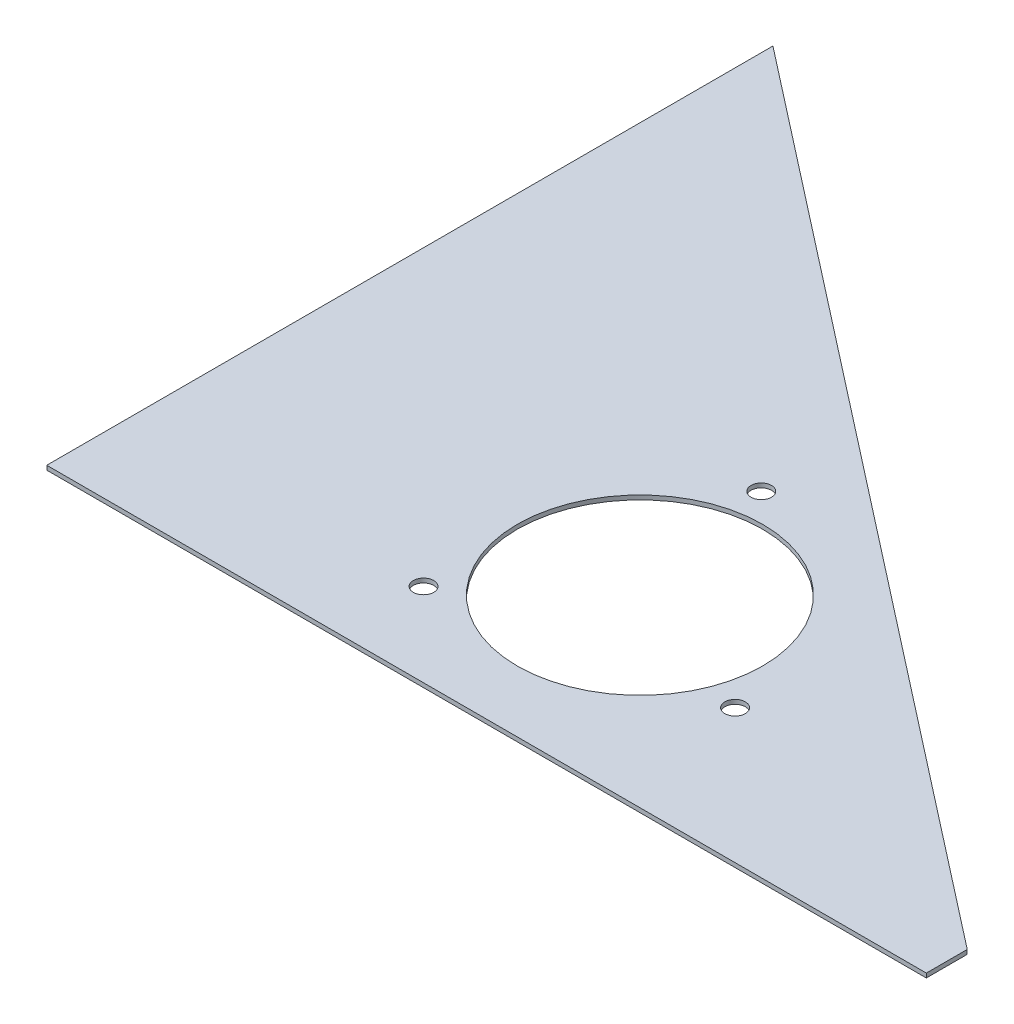
ISO-10303-21;
HEADER;
FILE_DESCRIPTION(('STEP AP214'),'2;1');
FILE_NAME('part.step','',(''),(''),'','','');
FILE_SCHEMA(('AUTOMOTIVE_DESIGN { 1 0 10303 214 1 1 1 1 }'));
ENDSEC;
DATA;
#1=APPLICATION_CONTEXT('core data for automotive mechanical design processes');
#2=APPLICATION_PROTOCOL_DEFINITION('international standard','automotive_design',2000,#1);
#3=PRODUCT_CONTEXT('',#1,'mechanical');
#4=PRODUCT('Part','Part','',(#3));
#5=PRODUCT_RELATED_PRODUCT_CATEGORY('part','',(#4));
#6=PRODUCT_DEFINITION_FORMATION('','',#4);
#7=PRODUCT_DEFINITION_CONTEXT('part definition',#1,'design');
#8=PRODUCT_DEFINITION('design','',#6,#7);
#9=PRODUCT_DEFINITION_SHAPE('','',#8);
#10=(LENGTH_UNIT() NAMED_UNIT(*) SI_UNIT(.MILLI.,.METRE.));
#11=(NAMED_UNIT(*) PLANE_ANGLE_UNIT() SI_UNIT($,.RADIAN.));
#12=(NAMED_UNIT(*) SI_UNIT($,.STERADIAN.) SOLID_ANGLE_UNIT());
#13=UNCERTAINTY_MEASURE_WITH_UNIT(LENGTH_MEASURE(1.E-05),#10,'distance_accuracy_value','');
#14=(GEOMETRIC_REPRESENTATION_CONTEXT(3) GLOBAL_UNCERTAINTY_ASSIGNED_CONTEXT((#13)) GLOBAL_UNIT_ASSIGNED_CONTEXT((#10,
#11,#12)) REPRESENTATION_CONTEXT('',''));
#15=CARTESIAN_POINT('',(0.,0.,0.));
#16=DIRECTION('',(0.,0.,1.));
#17=DIRECTION('',(1.,0.,0.));
#18=AXIS2_PLACEMENT_3D('',#15,#16,#17);
#19=CARTESIAN_POINT('',(546.1,2.65684,-25.4));
#20=DIRECTION('',(-0.614575452616154,0.,0.788858043656556));
#21=DIRECTION('',(0.788858043656556,0.,0.614575452616154));
#22=AXIS2_PLACEMENT_3D('',#19,#20,#21);
#23=PLANE('',#22);
#24=DIRECTION('',(-0.788858043656556,0.,-0.614575452616154));
#25=VECTOR('',#24,1.);
#26=CARTESIAN_POINT('',(546.1,0.,-25.4));
#27=LINE('',#26,#25);
#28=CARTESIAN_POINT('',(546.1,0.,-25.4));
#29=VERTEX_POINT('',#28);
#30=CARTESIAN_POINT('',(0.,0.,-450.85));
#31=VERTEX_POINT('',#30);
#32=EDGE_CURVE('E99',#29,#31,#27,.T.);
#33=ORIENTED_EDGE('',*,*,#32,.T.);
#34=DIRECTION('',(0.,-1.,0.));
#35=VECTOR('',#34,1.);
#36=CARTESIAN_POINT('',(0.,2.65684,-450.85));
#37=LINE('',#36,#35);
#38=CARTESIAN_POINT('',(0.,2.65684,-450.85));
#39=VERTEX_POINT('',#38);
#40=EDGE_CURVE('E11',#39,#31,#37,.T.);
#41=ORIENTED_EDGE('',*,*,#40,.F.);
#42=DIRECTION('',(-0.788858043656556,0.,-0.614575452616154));
#43=VECTOR('',#42,1.);
#44=CARTESIAN_POINT('',(546.1,2.65684,-25.4));
#45=LINE('',#44,#43);
#46=CARTESIAN_POINT('',(546.1,2.65684,-25.4));
#47=VERTEX_POINT('',#46);
#48=EDGE_CURVE('E87',#47,#39,#45,.T.);
#49=ORIENTED_EDGE('',*,*,#48,.F.);
#50=DIRECTION('',(0.,-1.,0.));
#51=VECTOR('',#50,1.);
#52=CARTESIAN_POINT('',(546.1,2.65684,-25.4));
#53=LINE('',#52,#51);
#54=EDGE_CURVE('E95',#47,#29,#53,.T.);
#55=ORIENTED_EDGE('',*,*,#54,.T.);
#56=EDGE_LOOP('',(#33,#41,#49,#55));
#57=FACE_BOUND('',#56,.T.);
#58=ADVANCED_FACE('F36',(#57),#23,.F.);
#59=CARTESIAN_POINT('',(0.,2.65684,-450.85));
#60=DIRECTION('',(1.,0.,0.));
#61=DIRECTION('',(0.,0.,-1.));
#62=AXIS2_PLACEMENT_3D('',#59,#60,#61);
#63=PLANE('',#62);
#64=DIRECTION('',(0.,0.,1.));
#65=VECTOR('',#64,1.);
#66=CARTESIAN_POINT('',(0.,0.,-450.85));
#67=LINE('',#66,#65);
#68=CARTESIAN_POINT('',(0.,0.,0.));
#69=VERTEX_POINT('',#68);
#70=EDGE_CURVE('E91',#31,#69,#67,.T.);
#71=ORIENTED_EDGE('',*,*,#70,.T.);
#72=DIRECTION('',(0.,-1.,0.));
#73=VECTOR('',#72,1.);
#74=CARTESIAN_POINT('',(0.,2.65684,0.));
#75=LINE('',#74,#73);
#76=CARTESIAN_POINT('',(0.,2.65684,0.));
#77=VERTEX_POINT('',#76);
#78=EDGE_CURVE('E44',#77,#69,#75,.T.);
#79=ORIENTED_EDGE('',*,*,#78,.F.);
#80=DIRECTION('',(0.,0.,1.));
#81=VECTOR('',#80,1.);
#82=CARTESIAN_POINT('',(0.,2.65684,-450.85));
#83=LINE('',#82,#81);
#84=EDGE_CURVE('E82',#39,#77,#83,.T.);
#85=ORIENTED_EDGE('',*,*,#84,.F.);
#86=ORIENTED_EDGE('',*,*,#40,.T.);
#87=EDGE_LOOP('',(#71,#79,#85,#86));
#88=FACE_BOUND('',#87,.T.);
#89=ADVANCED_FACE('F90',(#88),#63,.F.);
#90=CARTESIAN_POINT('',(0.,2.65684,0.));
#91=DIRECTION('',(0.,0.,-1.));
#92=DIRECTION('',(-1.,0.,0.));
#93=AXIS2_PLACEMENT_3D('',#90,#91,#92);
#94=PLANE('',#93);
#95=DIRECTION('',(1.,0.,0.));
#96=VECTOR('',#95,1.);
#97=CARTESIAN_POINT('',(0.,0.,0.));
#98=LINE('',#97,#96);
#99=CARTESIAN_POINT('',(546.1,0.,0.));
#100=VERTEX_POINT('',#99);
#101=EDGE_CURVE('E69',#69,#100,#98,.T.);
#102=ORIENTED_EDGE('',*,*,#101,.T.);
#103=DIRECTION('',(0.,-1.,0.));
#104=VECTOR('',#103,1.);
#105=CARTESIAN_POINT('',(546.1,2.65684,0.));
#106=LINE('',#105,#104);
#107=CARTESIAN_POINT('',(546.1,2.65684,0.));
#108=VERTEX_POINT('',#107);
#109=EDGE_CURVE('E92',#108,#100,#106,.T.);
#110=ORIENTED_EDGE('',*,*,#109,.F.);
#111=DIRECTION('',(1.,0.,0.));
#112=VECTOR('',#111,1.);
#113=CARTESIAN_POINT('',(0.,2.65684,0.));
#114=LINE('',#113,#112);
#115=EDGE_CURVE('E85',#77,#108,#114,.T.);
#116=ORIENTED_EDGE('',*,*,#115,.F.);
#117=ORIENTED_EDGE('',*,*,#78,.T.);
#118=EDGE_LOOP('',(#102,#110,#116,#117));
#119=FACE_BOUND('',#118,.T.);
#120=ADVANCED_FACE('F93',(#119),#94,.F.);
#121=CARTESIAN_POINT('',(546.1,2.65684,0.));
#122=DIRECTION('',(-1.,0.,0.));
#123=DIRECTION('',(0.,0.,1.));
#124=AXIS2_PLACEMENT_3D('',#121,#122,#123);
#125=PLANE('',#124);
#126=DIRECTION('',(0.,0.,-1.));
#127=VECTOR('',#126,1.);
#128=CARTESIAN_POINT('',(546.1,0.,0.));
#129=LINE('',#128,#127);
#130=EDGE_CURVE('E75',#100,#29,#129,.T.);
#131=ORIENTED_EDGE('',*,*,#130,.T.);
#132=ORIENTED_EDGE('',*,*,#54,.F.);
#133=DIRECTION('',(0.,0.,-1.));
#134=VECTOR('',#133,1.);
#135=CARTESIAN_POINT('',(546.1,2.65684,0.));
#136=LINE('',#135,#134);
#137=EDGE_CURVE('E52',#108,#47,#136,.T.);
#138=ORIENTED_EDGE('',*,*,#137,.F.);
#139=ORIENTED_EDGE('',*,*,#109,.T.);
#140=EDGE_LOOP('',(#131,#132,#138,#139));
#141=FACE_BOUND('',#140,.T.);
#142=ADVANCED_FACE('F107',(#141),#125,.F.);
#143=CARTESIAN_POINT('',(0.,2.65684,0.));
#144=DIRECTION('',(0.,1.,0.));
#145=DIRECTION('',(0.,0.,1.));
#146=AXIS2_PLACEMENT_3D('',#143,#144,#145);
#147=PLANE('',#146);
#148=CARTESIAN_POINT('',(182.113912483781,2.65684,-51.8103774886559));
#149=DIRECTION('',(0.,-1.,0.));
#150=DIRECTION('',(0.,0.,-1.));
#151=AXIS2_PLACEMENT_3D('',#148,#149,#150);
#152=CIRCLE('',#151,6.34999999999999);
#153=CARTESIAN_POINT('',(182.113912483781,2.65684,-58.1603774886558));
#154=VERTEX_POINT('',#153);
#155=EDGE_CURVE('E128',#154,#154,#152,.T.);
#156=ORIENTED_EDGE('',*,*,#155,.T.);
#157=EDGE_LOOP('',(#156));
#158=FACE_BOUND('',#157,.T.);
#159=CARTESIAN_POINT('',(235.825443190386,2.65684,-207.799989223392));
#160=DIRECTION('',(0.,-1.,0.));
#161=DIRECTION('',(0.,0.,-1.));
#162=AXIS2_PLACEMENT_3D('',#159,#160,#161);
#163=CIRCLE('',#162,6.34999999999996);
#164=CARTESIAN_POINT('',(235.825443190386,2.65684,-214.149989223392));
#165=VERTEX_POINT('',#164);
#166=EDGE_CURVE('E122',#165,#165,#163,.T.);
#167=ORIENTED_EDGE('',*,*,#166,.T.);
#168=EDGE_LOOP('',(#167));
#169=FACE_BOUND('',#168,.T.);
#170=CARTESIAN_POINT('',(344.060644325835,2.65684,-83.2896332879559));
#171=DIRECTION('',(0.,-1.,0.));
#172=DIRECTION('',(0.,0.,-1.));
#173=AXIS2_PLACEMENT_3D('',#170,#171,#172);
#174=CIRCLE('',#173,6.35);
#175=CARTESIAN_POINT('',(344.060644325835,2.65684,-89.6396332879559));
#176=VERTEX_POINT('',#175);
#177=EDGE_CURVE('E116',#176,#176,#174,.T.);
#178=ORIENTED_EDGE('',*,*,#177,.T.);
#179=EDGE_LOOP('',(#178));
#180=FACE_BOUND('',#179,.T.);
#181=CARTESIAN_POINT('',(254.,2.65684,-114.3));
#182=DIRECTION('',(0.,-1.,0.));
#183=DIRECTION('',(0.,0.,-1.));
#184=AXIS2_PLACEMENT_3D('',#181,#182,#183);
#185=CIRCLE('',#184,76.2);
#186=CARTESIAN_POINT('',(254.,2.65684,-190.5));
#187=VERTEX_POINT('',#186);
#188=EDGE_CURVE('E102',#187,#187,#185,.T.);
#189=ORIENTED_EDGE('',*,*,#188,.T.);
#190=EDGE_LOOP('',(#189));
#191=FACE_BOUND('',#190,.T.);
#192=ORIENTED_EDGE('',*,*,#48,.T.);
#193=ORIENTED_EDGE('',*,*,#84,.T.);
#194=ORIENTED_EDGE('',*,*,#115,.T.);
#195=ORIENTED_EDGE('',*,*,#137,.T.);
#196=EDGE_LOOP('',(#192,#193,#194,#195));
#197=FACE_BOUND('',#196,.T.);
#198=ADVANCED_FACE('F83',(#158,#169,#180,#191,#197),#147,.T.);
#199=CARTESIAN_POINT('',(0.,0.,0.));
#200=DIRECTION('',(0.,1.,0.));
#201=DIRECTION('',(0.,0.,1.));
#202=AXIS2_PLACEMENT_3D('',#199,#200,#201);
#203=PLANE('',#202);
#204=CARTESIAN_POINT('',(182.113912483781,0.,-51.8103774886559));
#205=DIRECTION('',(0.,-1.,0.));
#206=DIRECTION('',(0.,0.,-1.));
#207=AXIS2_PLACEMENT_3D('',#204,#205,#206);
#208=CIRCLE('',#207,6.34999999999999);
#209=CARTESIAN_POINT('',(182.113912483781,0.,-58.1603774886558));
#210=VERTEX_POINT('',#209);
#211=EDGE_CURVE('E131',#210,#210,#208,.T.);
#212=ORIENTED_EDGE('',*,*,#211,.F.);
#213=EDGE_LOOP('',(#212));
#214=FACE_BOUND('',#213,.T.);
#215=CARTESIAN_POINT('',(235.825443190386,0.,-207.799989223392));
#216=DIRECTION('',(0.,-1.,0.));
#217=DIRECTION('',(0.,0.,-1.));
#218=AXIS2_PLACEMENT_3D('',#215,#216,#217);
#219=CIRCLE('',#218,6.34999999999996);
#220=CARTESIAN_POINT('',(235.825443190386,0.,-214.149989223392));
#221=VERTEX_POINT('',#220);
#222=EDGE_CURVE('E125',#221,#221,#219,.T.);
#223=ORIENTED_EDGE('',*,*,#222,.F.);
#224=EDGE_LOOP('',(#223));
#225=FACE_BOUND('',#224,.T.);
#226=CARTESIAN_POINT('',(344.060644325835,0.,-83.2896332879559));
#227=DIRECTION('',(0.,-1.,0.));
#228=DIRECTION('',(0.,0.,-1.));
#229=AXIS2_PLACEMENT_3D('',#226,#227,#228);
#230=CIRCLE('',#229,6.35);
#231=CARTESIAN_POINT('',(344.060644325835,0.,-89.6396332879559));
#232=VERTEX_POINT('',#231);
#233=EDGE_CURVE('E119',#232,#232,#230,.T.);
#234=ORIENTED_EDGE('',*,*,#233,.F.);
#235=EDGE_LOOP('',(#234));
#236=FACE_BOUND('',#235,.T.);
#237=CARTESIAN_POINT('',(254.,0.,-114.3));
#238=DIRECTION('',(0.,-1.,0.));
#239=DIRECTION('',(0.,0.,-1.));
#240=AXIS2_PLACEMENT_3D('',#237,#238,#239);
#241=CIRCLE('',#240,76.2);
#242=CARTESIAN_POINT('',(254.,0.,-190.5));
#243=VERTEX_POINT('',#242);
#244=EDGE_CURVE('E113',#243,#243,#241,.T.);
#245=ORIENTED_EDGE('',*,*,#244,.F.);
#246=EDGE_LOOP('',(#245));
#247=FACE_BOUND('',#246,.T.);
#248=ORIENTED_EDGE('',*,*,#32,.F.);
#249=ORIENTED_EDGE('',*,*,#130,.F.);
#250=ORIENTED_EDGE('',*,*,#101,.F.);
#251=ORIENTED_EDGE('',*,*,#70,.F.);
#252=EDGE_LOOP('',(#248,#249,#250,#251));
#253=FACE_BOUND('',#252,.T.);
#254=ADVANCED_FACE('F110',(#214,#225,#236,#247,#253),#203,.F.);
#255=CARTESIAN_POINT('',(254.,2.65684,-114.3));
#256=DIRECTION('',(0.,-1.,0.));
#257=DIRECTION('',(0.,0.,-1.));
#258=AXIS2_PLACEMENT_3D('',#255,#256,#257);
#259=CYLINDRICAL_SURFACE('',#258,76.2);
#260=ORIENTED_EDGE('',*,*,#188,.F.);
#261=EDGE_LOOP('',(#260));
#262=FACE_BOUND('',#261,.T.);
#263=ORIENTED_EDGE('',*,*,#244,.T.);
#264=EDGE_LOOP('',(#263));
#265=FACE_BOUND('',#264,.T.);
#266=ADVANCED_FACE('F148',(#262,#265),#259,.F.);
#267=CARTESIAN_POINT('',(344.060644325835,2.65684,-83.2896332879559));
#268=DIRECTION('',(0.,-1.,0.));
#269=DIRECTION('',(0.,0.,-1.));
#270=AXIS2_PLACEMENT_3D('',#267,#268,#269);
#271=CYLINDRICAL_SURFACE('',#270,6.35);
#272=ORIENTED_EDGE('',*,*,#177,.F.);
#273=EDGE_LOOP('',(#272));
#274=FACE_BOUND('',#273,.T.);
#275=ORIENTED_EDGE('',*,*,#233,.T.);
#276=EDGE_LOOP('',(#275));
#277=FACE_BOUND('',#276,.T.);
#278=ADVANCED_FACE('F157',(#274,#277),#271,.F.);
#279=CARTESIAN_POINT('',(235.825443190386,2.65684,-207.799989223392));
#280=DIRECTION('',(0.,-1.,0.));
#281=DIRECTION('',(0.,0.,-1.));
#282=AXIS2_PLACEMENT_3D('',#279,#280,#281);
#283=CYLINDRICAL_SURFACE('',#282,6.34999999999996);
#284=ORIENTED_EDGE('',*,*,#166,.F.);
#285=EDGE_LOOP('',(#284));
#286=FACE_BOUND('',#285,.T.);
#287=ORIENTED_EDGE('',*,*,#222,.T.);
#288=EDGE_LOOP('',(#287));
#289=FACE_BOUND('',#288,.T.);
#290=ADVANCED_FACE('F142',(#286,#289),#283,.F.);
#291=CARTESIAN_POINT('',(182.113912483781,2.65684,-51.8103774886559));
#292=DIRECTION('',(0.,-1.,0.));
#293=DIRECTION('',(0.,0.,-1.));
#294=AXIS2_PLACEMENT_3D('',#291,#292,#293);
#295=CYLINDRICAL_SURFACE('',#294,6.34999999999999);
#296=ORIENTED_EDGE('',*,*,#155,.F.);
#297=EDGE_LOOP('',(#296));
#298=FACE_BOUND('',#297,.T.);
#299=ORIENTED_EDGE('',*,*,#211,.T.);
#300=EDGE_LOOP('',(#299));
#301=FACE_BOUND('',#300,.T.);
#302=ADVANCED_FACE('F139',(#298,#301),#295,.F.);
#303=CLOSED_SHELL('',(#58,#89,#120,#142,#198,#254,#266,#278,#290,#302));
#304=MANIFOLD_SOLID_BREP('B2',#303);
#305=ADVANCED_BREP_SHAPE_REPRESENTATION('',(#18,#304),#14);
#306=SHAPE_DEFINITION_REPRESENTATION(#9,#305);
ENDSEC;
END-ISO-10303-21;
